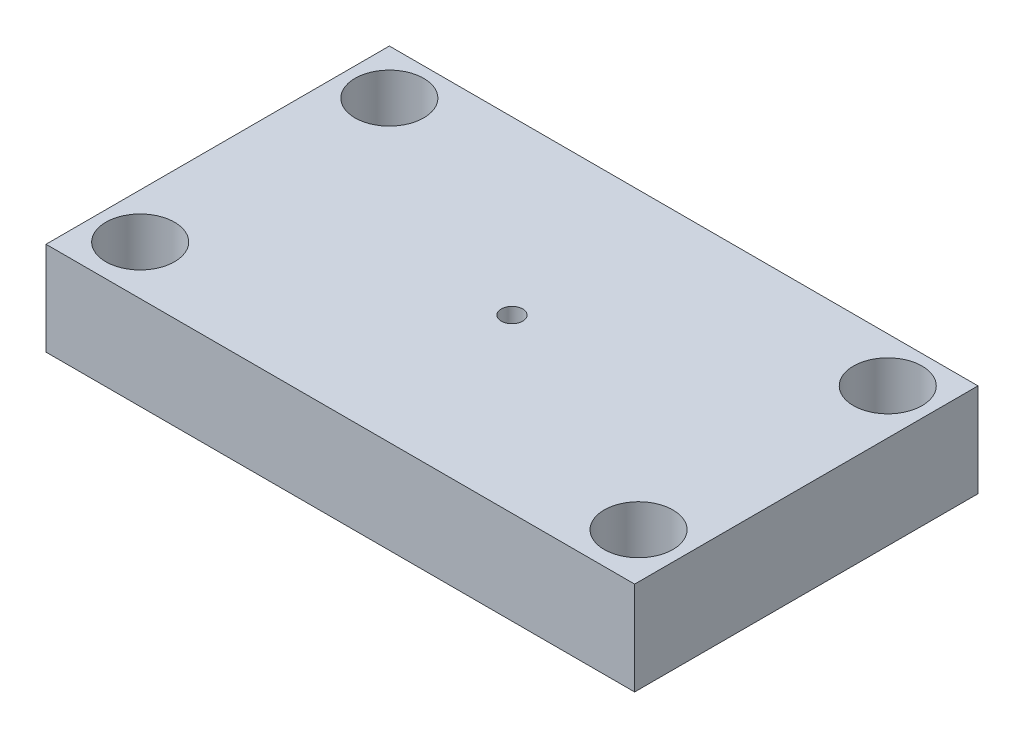
ISO-10303-21;
HEADER;
FILE_DESCRIPTION(('STEP AP214'),'2;1');
FILE_NAME('part.step','',(''),(''),'','','');
FILE_SCHEMA(('AUTOMOTIVE_DESIGN { 1 0 10303 214 1 1 1 1 }'));
ENDSEC;
DATA;
#1=APPLICATION_CONTEXT('core data for automotive mechanical design processes');
#2=APPLICATION_PROTOCOL_DEFINITION('international standard','automotive_design',2000,#1);
#3=PRODUCT_CONTEXT('',#1,'mechanical');
#4=PRODUCT('Part','Part','',(#3));
#5=PRODUCT_RELATED_PRODUCT_CATEGORY('part','',(#4));
#6=PRODUCT_DEFINITION_FORMATION('','',#4);
#7=PRODUCT_DEFINITION_CONTEXT('part definition',#1,'design');
#8=PRODUCT_DEFINITION('design','',#6,#7);
#9=PRODUCT_DEFINITION_SHAPE('','',#8);
#10=(LENGTH_UNIT() NAMED_UNIT(*) SI_UNIT(.MILLI.,.METRE.));
#11=(NAMED_UNIT(*) PLANE_ANGLE_UNIT() SI_UNIT($,.RADIAN.));
#12=(NAMED_UNIT(*) SI_UNIT($,.STERADIAN.) SOLID_ANGLE_UNIT());
#13=UNCERTAINTY_MEASURE_WITH_UNIT(LENGTH_MEASURE(1.E-05),#10,'distance_accuracy_value','');
#14=(GEOMETRIC_REPRESENTATION_CONTEXT(3) GLOBAL_UNCERTAINTY_ASSIGNED_CONTEXT((#13)) GLOBAL_UNIT_ASSIGNED_CONTEXT((#10,
#11,#12)) REPRESENTATION_CONTEXT('',''));
#15=CARTESIAN_POINT('',(0.,0.,0.));
#16=DIRECTION('',(0.,0.,1.));
#17=DIRECTION('',(1.,0.,0.));
#18=AXIS2_PLACEMENT_3D('',#15,#16,#17);
#19=CARTESIAN_POINT('',(0.,9.525,0.));
#20=DIRECTION('',(0.,-1.,0.));
#21=DIRECTION('',(0.,0.,-1.));
#22=AXIS2_PLACEMENT_3D('',#19,#20,#21);
#23=PLANE('',#22);
#24=DIRECTION('',(0.,0.,1.));
#25=VECTOR('',#24,1.);
#26=CARTESIAN_POINT('',(0.,9.525,0.));
#27=LINE('',#26,#25);
#28=CARTESIAN_POINT('',(0.,9.525,-35.));
#29=VERTEX_POINT('',#28);
#30=CARTESIAN_POINT('',(0.,9.525,0.));
#31=VERTEX_POINT('',#30);
#32=EDGE_CURVE('E96',#29,#31,#27,.T.);
#33=ORIENTED_EDGE('',*,*,#32,.T.);
#34=DIRECTION('',(1.,0.,0.));
#35=VECTOR('',#34,1.);
#36=CARTESIAN_POINT('',(0.,9.525,0.));
#37=LINE('',#36,#35);
#38=CARTESIAN_POINT('',(60.,9.525,0.));
#39=VERTEX_POINT('',#38);
#40=EDGE_CURVE('E91',#31,#39,#37,.T.);
#41=ORIENTED_EDGE('',*,*,#40,.T.);
#42=DIRECTION('',(0.,0.,-1.));
#43=VECTOR('',#42,1.);
#44=CARTESIAN_POINT('',(60.,9.525,0.));
#45=LINE('',#44,#43);
#46=CARTESIAN_POINT('',(60.,9.525,-35.));
#47=VERTEX_POINT('',#46);
#48=EDGE_CURVE('E94',#39,#47,#45,.T.);
#49=ORIENTED_EDGE('',*,*,#48,.T.);
#50=DIRECTION('',(-1.,0.,0.));
#51=VECTOR('',#50,1.);
#52=CARTESIAN_POINT('',(0.,9.525,-35.));
#53=LINE('',#52,#51);
#54=EDGE_CURVE('E61',#47,#29,#53,.T.);
#55=ORIENTED_EDGE('',*,*,#54,.T.);
#56=EDGE_LOOP('',(#33,#41,#49,#55));
#57=FACE_BOUND('',#56,.T.);
#58=CARTESIAN_POINT('',(4.6,9.525,-30.4));
#59=DIRECTION('',(0.,1.,0.));
#60=DIRECTION('',(0.,0.,1.));
#61=AXIS2_PLACEMENT_3D('',#58,#59,#60);
#62=CIRCLE('',#61,3.5);
#63=CARTESIAN_POINT('',(4.6,9.525,-26.9));
#64=VERTEX_POINT('',#63);
#65=EDGE_CURVE('E116',#64,#64,#62,.T.);
#66=ORIENTED_EDGE('',*,*,#65,.F.);
#67=EDGE_LOOP('',(#66));
#68=FACE_BOUND('',#67,.T.);
#69=CARTESIAN_POINT('',(55.4,9.525,-30.4));
#70=DIRECTION('',(0.,1.,0.));
#71=DIRECTION('',(0.,0.,1.));
#72=AXIS2_PLACEMENT_3D('',#69,#70,#71);
#73=CIRCLE('',#72,3.5);
#74=CARTESIAN_POINT('',(55.4,9.525,-26.9));
#75=VERTEX_POINT('',#74);
#76=EDGE_CURVE('E138',#75,#75,#73,.T.);
#77=ORIENTED_EDGE('',*,*,#76,.F.);
#78=EDGE_LOOP('',(#77));
#79=FACE_BOUND('',#78,.T.);
#80=CARTESIAN_POINT('',(4.6,9.525,-5.));
#81=DIRECTION('',(0.,1.,0.));
#82=DIRECTION('',(0.,0.,1.));
#83=AXIS2_PLACEMENT_3D('',#80,#81,#82);
#84=CIRCLE('',#83,3.5);
#85=CARTESIAN_POINT('',(4.6,9.525,-1.5));
#86=VERTEX_POINT('',#85);
#87=EDGE_CURVE('E146',#86,#86,#84,.T.);
#88=ORIENTED_EDGE('',*,*,#87,.F.);
#89=EDGE_LOOP('',(#88));
#90=FACE_BOUND('',#89,.T.);
#91=CARTESIAN_POINT('',(55.4,9.525,-5.));
#92=DIRECTION('',(0.,1.,0.));
#93=DIRECTION('',(0.,0.,1.));
#94=AXIS2_PLACEMENT_3D('',#91,#92,#93);
#95=CIRCLE('',#94,3.5);
#96=CARTESIAN_POINT('',(55.4,9.525,-1.5));
#97=VERTEX_POINT('',#96);
#98=EDGE_CURVE('E154',#97,#97,#95,.T.);
#99=ORIENTED_EDGE('',*,*,#98,.F.);
#100=EDGE_LOOP('',(#99));
#101=FACE_BOUND('',#100,.T.);
#102=CARTESIAN_POINT('',(30.,9.525,-17.5));
#103=DIRECTION('',(0.,1.,0.));
#104=DIRECTION('',(0.,0.,1.));
#105=AXIS2_PLACEMENT_3D('',#102,#103,#104);
#106=CIRCLE('',#105,1.0875);
#107=CARTESIAN_POINT('',(30.,9.525,-16.4125));
#108=VERTEX_POINT('',#107);
#109=EDGE_CURVE('E162',#108,#108,#106,.T.);
#110=ORIENTED_EDGE('',*,*,#109,.F.);
#111=EDGE_LOOP('',(#110));
#112=FACE_BOUND('',#111,.T.);
#113=ADVANCED_FACE('F43',(#57,#68,#79,#90,#101,#112),#23,.F.);
#114=CARTESIAN_POINT('',(0.,0.,0.));
#115=DIRECTION('',(0.,-1.,0.));
#116=DIRECTION('',(0.,0.,-1.));
#117=AXIS2_PLACEMENT_3D('',#114,#115,#116);
#118=PLANE('',#117);
#119=CARTESIAN_POINT('',(55.4,0.,-5.));
#120=DIRECTION('',(0.,1.,0.));
#121=DIRECTION('',(0.,0.,1.));
#122=AXIS2_PLACEMENT_3D('',#119,#120,#121);
#123=CIRCLE('',#122,3.5);
#124=CARTESIAN_POINT('',(55.4,0.,-1.5));
#125=VERTEX_POINT('',#124);
#126=EDGE_CURVE('E158',#125,#125,#123,.T.);
#127=ORIENTED_EDGE('',*,*,#126,.T.);
#128=EDGE_LOOP('',(#127));
#129=FACE_BOUND('',#128,.T.);
#130=CARTESIAN_POINT('',(55.4,0.,-30.4));
#131=DIRECTION('',(0.,1.,0.));
#132=DIRECTION('',(0.,0.,1.));
#133=AXIS2_PLACEMENT_3D('',#130,#131,#132);
#134=CIRCLE('',#133,3.5);
#135=CARTESIAN_POINT('',(55.4,0.,-26.9));
#136=VERTEX_POINT('',#135);
#137=EDGE_CURVE('E142',#136,#136,#134,.T.);
#138=ORIENTED_EDGE('',*,*,#137,.T.);
#139=EDGE_LOOP('',(#138));
#140=FACE_BOUND('',#139,.T.);
#141=DIRECTION('',(0.,0.,1.));
#142=VECTOR('',#141,1.);
#143=CARTESIAN_POINT('',(0.,0.,0.));
#144=LINE('',#143,#142);
#145=CARTESIAN_POINT('',(0.,0.,-35.));
#146=VERTEX_POINT('',#145);
#147=CARTESIAN_POINT('',(0.,0.,0.));
#148=VERTEX_POINT('',#147);
#149=EDGE_CURVE('E112',#146,#148,#144,.T.);
#150=ORIENTED_EDGE('',*,*,#149,.F.);
#151=DIRECTION('',(-1.,0.,0.));
#152=VECTOR('',#151,1.);
#153=CARTESIAN_POINT('',(0.,0.,-35.));
#154=LINE('',#153,#152);
#155=CARTESIAN_POINT('',(60.,0.,-35.));
#156=VERTEX_POINT('',#155);
#157=EDGE_CURVE('E84',#156,#146,#154,.T.);
#158=ORIENTED_EDGE('',*,*,#157,.F.);
#159=DIRECTION('',(0.,0.,-1.));
#160=VECTOR('',#159,1.);
#161=CARTESIAN_POINT('',(60.,0.,0.));
#162=LINE('',#161,#160);
#163=CARTESIAN_POINT('',(60.,0.,0.));
#164=VERTEX_POINT('',#163);
#165=EDGE_CURVE('E78',#164,#156,#162,.T.);
#166=ORIENTED_EDGE('',*,*,#165,.F.);
#167=DIRECTION('',(1.,0.,0.));
#168=VECTOR('',#167,1.);
#169=CARTESIAN_POINT('',(0.,0.,0.));
#170=LINE('',#169,#168);
#171=EDGE_CURVE('E101',#148,#164,#170,.T.);
#172=ORIENTED_EDGE('',*,*,#171,.F.);
#173=EDGE_LOOP('',(#150,#158,#166,#172));
#174=FACE_BOUND('',#173,.T.);
#175=CARTESIAN_POINT('',(4.6,0.,-30.4));
#176=DIRECTION('',(0.,1.,0.));
#177=DIRECTION('',(0.,0.,1.));
#178=AXIS2_PLACEMENT_3D('',#175,#176,#177);
#179=CIRCLE('',#178,3.5);
#180=CARTESIAN_POINT('',(4.6,0.,-26.9));
#181=VERTEX_POINT('',#180);
#182=EDGE_CURVE('E134',#181,#181,#179,.T.);
#183=ORIENTED_EDGE('',*,*,#182,.T.);
#184=EDGE_LOOP('',(#183));
#185=FACE_BOUND('',#184,.T.);
#186=CARTESIAN_POINT('',(4.6,0.,-5.));
#187=DIRECTION('',(0.,1.,0.));
#188=DIRECTION('',(0.,0.,1.));
#189=AXIS2_PLACEMENT_3D('',#186,#187,#188);
#190=CIRCLE('',#189,3.5);
#191=CARTESIAN_POINT('',(4.6,0.,-1.5));
#192=VERTEX_POINT('',#191);
#193=EDGE_CURVE('E150',#192,#192,#190,.T.);
#194=ORIENTED_EDGE('',*,*,#193,.T.);
#195=EDGE_LOOP('',(#194));
#196=FACE_BOUND('',#195,.T.);
#197=CARTESIAN_POINT('',(30.,0.,-17.5));
#198=DIRECTION('',(0.,1.,0.));
#199=DIRECTION('',(0.,0.,1.));
#200=AXIS2_PLACEMENT_3D('',#197,#198,#199);
#201=CIRCLE('',#200,1.0875);
#202=CARTESIAN_POINT('',(30.,0.,-16.4125));
#203=VERTEX_POINT('',#202);
#204=EDGE_CURVE('E166',#203,#203,#201,.T.);
#205=ORIENTED_EDGE('',*,*,#204,.T.);
#206=EDGE_LOOP('',(#205));
#207=FACE_BOUND('',#206,.T.);
#208=ADVANCED_FACE('F129',(#129,#140,#174,#185,#196,#207),#118,.T.);
#209=CARTESIAN_POINT('',(0.,9.525,0.));
#210=DIRECTION('',(1.,0.,0.));
#211=DIRECTION('',(0.,0.,-1.));
#212=AXIS2_PLACEMENT_3D('',#209,#210,#211);
#213=PLANE('',#212);
#214=ORIENTED_EDGE('',*,*,#149,.T.);
#215=DIRECTION('',(0.,-1.,0.));
#216=VECTOR('',#215,1.);
#217=CARTESIAN_POINT('',(0.,9.525,0.));
#218=LINE('',#217,#216);
#219=EDGE_CURVE('E11',#31,#148,#218,.T.);
#220=ORIENTED_EDGE('',*,*,#219,.F.);
#221=ORIENTED_EDGE('',*,*,#32,.F.);
#222=DIRECTION('',(0.,-1.,0.));
#223=VECTOR('',#222,1.);
#224=CARTESIAN_POINT('',(0.,9.525,-35.));
#225=LINE('',#224,#223);
#226=EDGE_CURVE('E108',#29,#146,#225,.T.);
#227=ORIENTED_EDGE('',*,*,#226,.T.);
#228=EDGE_LOOP('',(#214,#220,#221,#227));
#229=FACE_BOUND('',#228,.T.);
#230=ADVANCED_FACE('F45',(#229),#213,.F.);
#231=CARTESIAN_POINT('',(0.,9.525,0.));
#232=DIRECTION('',(0.,0.,-1.));
#233=DIRECTION('',(-1.,0.,0.));
#234=AXIS2_PLACEMENT_3D('',#231,#232,#233);
#235=PLANE('',#234);
#236=ORIENTED_EDGE('',*,*,#171,.T.);
#237=DIRECTION('',(0.,-1.,0.));
#238=VECTOR('',#237,1.);
#239=CARTESIAN_POINT('',(60.,9.525,0.));
#240=LINE('',#239,#238);
#241=EDGE_CURVE('E53',#39,#164,#240,.T.);
#242=ORIENTED_EDGE('',*,*,#241,.F.);
#243=ORIENTED_EDGE('',*,*,#40,.F.);
#244=ORIENTED_EDGE('',*,*,#219,.T.);
#245=EDGE_LOOP('',(#236,#242,#243,#244));
#246=FACE_BOUND('',#245,.T.);
#247=ADVANCED_FACE('F100',(#246),#235,.F.);
#248=CARTESIAN_POINT('',(60.,9.525,0.));
#249=DIRECTION('',(-1.,0.,0.));
#250=DIRECTION('',(0.,0.,1.));
#251=AXIS2_PLACEMENT_3D('',#248,#249,#250);
#252=PLANE('',#251);
#253=ORIENTED_EDGE('',*,*,#165,.T.);
#254=DIRECTION('',(0.,-1.,0.));
#255=VECTOR('',#254,1.);
#256=CARTESIAN_POINT('',(60.,9.525,-35.));
#257=LINE('',#256,#255);
#258=EDGE_CURVE('E103',#47,#156,#257,.T.);
#259=ORIENTED_EDGE('',*,*,#258,.F.);
#260=ORIENTED_EDGE('',*,*,#48,.F.);
#261=ORIENTED_EDGE('',*,*,#241,.T.);
#262=EDGE_LOOP('',(#253,#259,#260,#261));
#263=FACE_BOUND('',#262,.T.);
#264=ADVANCED_FACE('F104',(#263),#252,.F.);
#265=CARTESIAN_POINT('',(0.,9.525,-35.));
#266=DIRECTION('',(0.,0.,1.));
#267=DIRECTION('',(1.,0.,0.));
#268=AXIS2_PLACEMENT_3D('',#265,#266,#267);
#269=PLANE('',#268);
#270=ORIENTED_EDGE('',*,*,#157,.T.);
#271=ORIENTED_EDGE('',*,*,#226,.F.);
#272=ORIENTED_EDGE('',*,*,#54,.F.);
#273=ORIENTED_EDGE('',*,*,#258,.T.);
#274=EDGE_LOOP('',(#270,#271,#272,#273));
#275=FACE_BOUND('',#274,.T.);
#276=ADVANCED_FACE('F126',(#275),#269,.F.);
#277=CARTESIAN_POINT('',(4.6,9.525,-30.4));
#278=DIRECTION('',(0.,-1.,0.));
#279=DIRECTION('',(0.,0.,-1.));
#280=AXIS2_PLACEMENT_3D('',#277,#278,#279);
#281=CYLINDRICAL_SURFACE('',#280,3.5);
#282=ORIENTED_EDGE('',*,*,#65,.T.);
#283=EDGE_LOOP('',(#282));
#284=FACE_BOUND('',#283,.T.);
#285=ORIENTED_EDGE('',*,*,#182,.F.);
#286=EDGE_LOOP('',(#285));
#287=FACE_BOUND('',#286,.T.);
#288=ADVANCED_FACE('F185',(#284,#287),#281,.F.);
#289=CARTESIAN_POINT('',(55.4,9.525,-30.4));
#290=DIRECTION('',(0.,-1.,0.));
#291=DIRECTION('',(0.,0.,-1.));
#292=AXIS2_PLACEMENT_3D('',#289,#290,#291);
#293=CYLINDRICAL_SURFACE('',#292,3.5);
#294=ORIENTED_EDGE('',*,*,#76,.T.);
#295=EDGE_LOOP('',(#294));
#296=FACE_BOUND('',#295,.T.);
#297=ORIENTED_EDGE('',*,*,#137,.F.);
#298=EDGE_LOOP('',(#297));
#299=FACE_BOUND('',#298,.T.);
#300=ADVANCED_FACE('F239',(#296,#299),#293,.F.);
#301=CARTESIAN_POINT('',(4.6,9.525,-5.));
#302=DIRECTION('',(0.,-1.,0.));
#303=DIRECTION('',(0.,0.,-1.));
#304=AXIS2_PLACEMENT_3D('',#301,#302,#303);
#305=CYLINDRICAL_SURFACE('',#304,3.5);
#306=ORIENTED_EDGE('',*,*,#87,.T.);
#307=EDGE_LOOP('',(#306));
#308=FACE_BOUND('',#307,.T.);
#309=ORIENTED_EDGE('',*,*,#193,.F.);
#310=EDGE_LOOP('',(#309));
#311=FACE_BOUND('',#310,.T.);
#312=ADVANCED_FACE('F248',(#308,#311),#305,.F.);
#313=CARTESIAN_POINT('',(55.4,9.525,-5.));
#314=DIRECTION('',(0.,-1.,0.));
#315=DIRECTION('',(0.,0.,-1.));
#316=AXIS2_PLACEMENT_3D('',#313,#314,#315);
#317=CYLINDRICAL_SURFACE('',#316,3.5);
#318=ORIENTED_EDGE('',*,*,#98,.T.);
#319=EDGE_LOOP('',(#318));
#320=FACE_BOUND('',#319,.T.);
#321=ORIENTED_EDGE('',*,*,#126,.F.);
#322=EDGE_LOOP('',(#321));
#323=FACE_BOUND('',#322,.T.);
#324=ADVANCED_FACE('F257',(#320,#323),#317,.F.);
#325=CARTESIAN_POINT('',(30.,9.525,-17.5));
#326=DIRECTION('',(0.,-1.,0.));
#327=DIRECTION('',(0.,0.,-1.));
#328=AXIS2_PLACEMENT_3D('',#325,#326,#327);
#329=CYLINDRICAL_SURFACE('',#328,1.0875);
#330=ORIENTED_EDGE('',*,*,#109,.T.);
#331=EDGE_LOOP('',(#330));
#332=FACE_BOUND('',#331,.T.);
#333=ORIENTED_EDGE('',*,*,#204,.F.);
#334=EDGE_LOOP('',(#333));
#335=FACE_BOUND('',#334,.T.);
#336=ADVANCED_FACE('F174',(#332,#335),#329,.F.);
#337=CLOSED_SHELL('',(#113,#208,#230,#247,#264,#276,#288,#300,#312,#324,#336));
#338=MANIFOLD_SOLID_BREP('B2',#337);
#339=ADVANCED_BREP_SHAPE_REPRESENTATION('',(#18,#338),#14);
#340=SHAPE_DEFINITION_REPRESENTATION(#9,#339);
ENDSEC;
END-ISO-10303-21;
